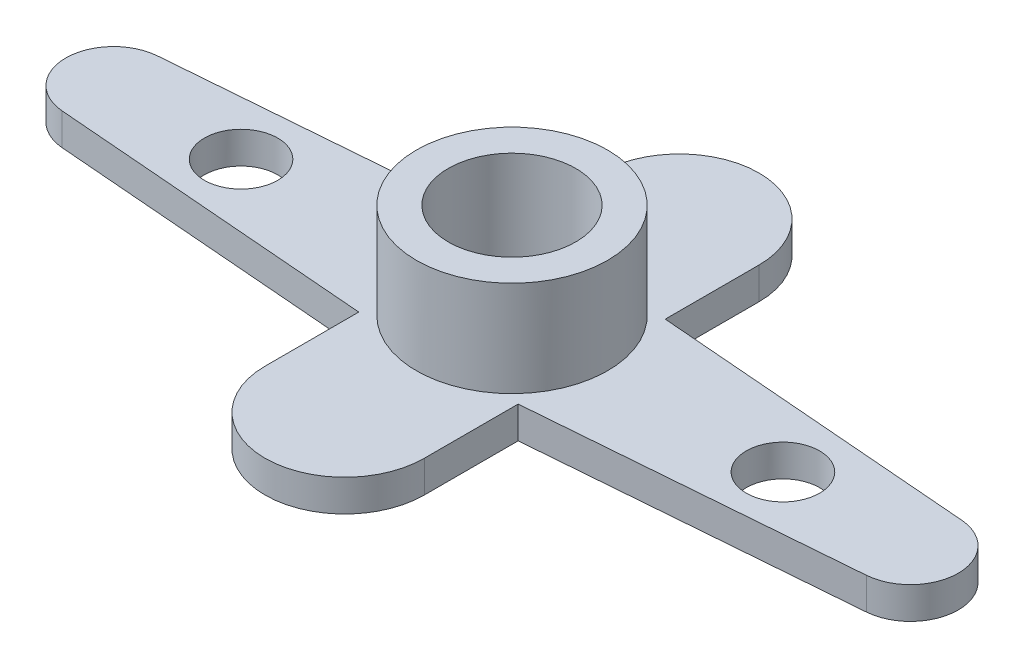
ISO-10303-21;
HEADER;
FILE_DESCRIPTION(('STEP AP214'),'2;1');
FILE_NAME('part.step','',(''),(''),'','','');
FILE_SCHEMA(('AUTOMOTIVE_DESIGN { 1 0 10303 214 1 1 1 1 }'));
ENDSEC;
DATA;
#1=APPLICATION_CONTEXT('core data for automotive mechanical design processes');
#2=APPLICATION_PROTOCOL_DEFINITION('international standard','automotive_design',2000,#1);
#3=PRODUCT_CONTEXT('',#1,'mechanical');
#4=PRODUCT('Part','Part','',(#3));
#5=PRODUCT_RELATED_PRODUCT_CATEGORY('part','',(#4));
#6=PRODUCT_DEFINITION_FORMATION('','',#4);
#7=PRODUCT_DEFINITION_CONTEXT('part definition',#1,'design');
#8=PRODUCT_DEFINITION('design','',#6,#7);
#9=PRODUCT_DEFINITION_SHAPE('','',#8);
#10=(LENGTH_UNIT() NAMED_UNIT(*) SI_UNIT(.MILLI.,.METRE.));
#11=(NAMED_UNIT(*) PLANE_ANGLE_UNIT() SI_UNIT($,.RADIAN.));
#12=(NAMED_UNIT(*) SI_UNIT($,.STERADIAN.) SOLID_ANGLE_UNIT());
#13=UNCERTAINTY_MEASURE_WITH_UNIT(LENGTH_MEASURE(1.E-05),#10,'distance_accuracy_value','');
#14=(GEOMETRIC_REPRESENTATION_CONTEXT(3) GLOBAL_UNCERTAINTY_ASSIGNED_CONTEXT((#13)) GLOBAL_UNIT_ASSIGNED_CONTEXT((#10,
#11,#12)) REPRESENTATION_CONTEXT('',''));
#15=CARTESIAN_POINT('',(0.,0.,0.));
#16=DIRECTION('',(0.,0.,1.));
#17=DIRECTION('',(1.,0.,0.));
#18=AXIS2_PLACEMENT_3D('',#15,#16,#17);
#19=CARTESIAN_POINT('',(12.5,1.,0.));
#20=DIRECTION('',(0.,-1.,0.));
#21=DIRECTION('',(0.,0.,-1.));
#22=AXIS2_PLACEMENT_3D('',#19,#20,#21);
#23=PLANE('',#22);
#24=CARTESIAN_POINT('',(12.5,1.,0.));
#25=DIRECTION('',(0.,1.,0.));
#26=DIRECTION('',(0.,0.,-1.));
#27=AXIS2_PLACEMENT_3D('',#24,#25,#26);
#28=CIRCLE('',#27,1.5);
#29=CARTESIAN_POINT('',(12.62,1.,1.49519229532525));
#30=VERTEX_POINT('',#29);
#31=CARTESIAN_POINT('',(12.62,1.,-1.49519229532525));
#32=VERTEX_POINT('',#31);
#33=EDGE_CURVE('E182',#30,#32,#28,.T.);
#34=ORIENTED_EDGE('',*,*,#33,.T.);
#35=DIRECTION('',(-0.996794863550169,0.,-0.08));
#36=VECTOR('',#35,1.);
#37=CARTESIAN_POINT('',(12.62,1.,-1.49519229532525));
#38=LINE('',#37,#36);
#39=CARTESIAN_POINT('',(2.5,1.,-2.30739551747724));
#40=VERTEX_POINT('',#39);
#41=EDGE_CURVE('E110',#32,#40,#38,.T.);
#42=ORIENTED_EDGE('',*,*,#41,.T.);
#43=DIRECTION('',(0.,0.,-1.));
#44=VECTOR('',#43,1.);
#45=CARTESIAN_POINT('',(2.5,1.,-2.30739551747724));
#46=LINE('',#45,#44);
#47=CARTESIAN_POINT('',(2.5,1.,-5.25));
#48=VERTEX_POINT('',#47);
#49=EDGE_CURVE('E232',#40,#48,#46,.T.);
#50=ORIENTED_EDGE('',*,*,#49,.T.);
#51=CARTESIAN_POINT('',(0.,1.,-5.25));
#52=DIRECTION('',(0.,1.,0.));
#53=DIRECTION('',(0.,0.,1.));
#54=AXIS2_PLACEMENT_3D('',#51,#52,#53);
#55=CIRCLE('',#54,2.5);
#56=CARTESIAN_POINT('',(-2.5,1.,-5.25));
#57=VERTEX_POINT('',#56);
#58=EDGE_CURVE('E234',#48,#57,#55,.T.);
#59=ORIENTED_EDGE('',*,*,#58,.T.);
#60=DIRECTION('',(0.,0.,1.));
#61=VECTOR('',#60,1.);
#62=CARTESIAN_POINT('',(-2.5,1.,-2.30739551747724));
#63=LINE('',#62,#61);
#64=CARTESIAN_POINT('',(-2.5,1.,-2.30739551747724));
#65=VERTEX_POINT('',#64);
#66=EDGE_CURVE('E236',#57,#65,#63,.T.);
#67=ORIENTED_EDGE('',*,*,#66,.T.);
#68=DIRECTION('',(-0.996794863550169,0.,0.08));
#69=VECTOR('',#68,1.);
#70=CARTESIAN_POINT('',(-12.62,1.,-1.49519229532525));
#71=LINE('',#70,#69);
#72=CARTESIAN_POINT('',(-12.62,1.,-1.49519229532525));
#73=VERTEX_POINT('',#72);
#74=EDGE_CURVE('E238',#65,#73,#71,.T.);
#75=ORIENTED_EDGE('',*,*,#74,.T.);
#76=CARTESIAN_POINT('',(-12.5,1.,0.));
#77=DIRECTION('',(0.,1.,0.));
#78=DIRECTION('',(0.,0.,1.));
#79=AXIS2_PLACEMENT_3D('',#76,#77,#78);
#80=CIRCLE('',#79,1.5);
#81=CARTESIAN_POINT('',(-12.62,1.,1.49519229532525));
#82=VERTEX_POINT('',#81);
#83=EDGE_CURVE('E240',#73,#82,#80,.T.);
#84=ORIENTED_EDGE('',*,*,#83,.T.);
#85=DIRECTION('',(0.996794863550169,0.,0.08));
#86=VECTOR('',#85,1.);
#87=CARTESIAN_POINT('',(-12.62,1.,1.49519229532525));
#88=LINE('',#87,#86);
#89=CARTESIAN_POINT('',(-2.5,1.,2.30739551747724));
#90=VERTEX_POINT('',#89);
#91=EDGE_CURVE('E242',#82,#90,#88,.T.);
#92=ORIENTED_EDGE('',*,*,#91,.T.);
#93=DIRECTION('',(0.,0.,1.));
#94=VECTOR('',#93,1.);
#95=CARTESIAN_POINT('',(-2.5,1.,2.30739551747724));
#96=LINE('',#95,#94);
#97=CARTESIAN_POINT('',(-2.5,1.,5.25));
#98=VERTEX_POINT('',#97);
#99=EDGE_CURVE('E141',#90,#98,#96,.T.);
#100=ORIENTED_EDGE('',*,*,#99,.T.);
#101=CARTESIAN_POINT('',(0.,1.,5.25));
#102=DIRECTION('',(0.,1.,0.));
#103=DIRECTION('',(0.,0.,-1.));
#104=AXIS2_PLACEMENT_3D('',#101,#102,#103);
#105=CIRCLE('',#104,2.5);
#106=CARTESIAN_POINT('',(2.5,1.,5.25));
#107=VERTEX_POINT('',#106);
#108=EDGE_CURVE('E135',#98,#107,#105,.T.);
#109=ORIENTED_EDGE('',*,*,#108,.T.);
#110=DIRECTION('',(0.,0.,-1.));
#111=VECTOR('',#110,1.);
#112=CARTESIAN_POINT('',(2.5,1.,2.30739551747724));
#113=LINE('',#112,#111);
#114=CARTESIAN_POINT('',(2.5,1.,2.30739551747724));
#115=VERTEX_POINT('',#114);
#116=EDGE_CURVE('E139',#107,#115,#113,.T.);
#117=ORIENTED_EDGE('',*,*,#116,.T.);
#118=DIRECTION('',(0.996794863550169,0.,-0.08));
#119=VECTOR('',#118,1.);
#120=CARTESIAN_POINT('',(12.62,1.,1.49519229532525));
#121=LINE('',#120,#119);
#122=EDGE_CURVE('E54',#115,#30,#121,.T.);
#123=ORIENTED_EDGE('',*,*,#122,.T.);
#124=EDGE_LOOP('',(#34,#42,#50,#59,#67,#75,#84,#92,#100,#109,#117,#123));
#125=FACE_BOUND('',#124,.T.);
#126=CARTESIAN_POINT('',(-8.5,1.,0.));
#127=DIRECTION('',(0.,1.,0.));
#128=DIRECTION('',(0.,0.,1.));
#129=AXIS2_PLACEMENT_3D('',#126,#127,#128);
#130=CIRCLE('',#129,1.15);
#131=CARTESIAN_POINT('',(-8.5,1.,1.15));
#132=VERTEX_POINT('',#131);
#133=EDGE_CURVE('E210',#132,#132,#130,.T.);
#134=ORIENTED_EDGE('',*,*,#133,.F.);
#135=EDGE_LOOP('',(#134));
#136=FACE_BOUND('',#135,.T.);
#137=CARTESIAN_POINT('',(8.5,1.,0.));
#138=DIRECTION('',(0.,1.,0.));
#139=DIRECTION('',(0.,0.,1.));
#140=AXIS2_PLACEMENT_3D('',#137,#138,#139);
#141=CIRCLE('',#140,1.15);
#142=CARTESIAN_POINT('',(8.5,1.,1.15));
#143=VERTEX_POINT('',#142);
#144=EDGE_CURVE('E213',#143,#143,#141,.T.);
#145=ORIENTED_EDGE('',*,*,#144,.F.);
#146=EDGE_LOOP('',(#145));
#147=FACE_BOUND('',#146,.T.);
#148=CARTESIAN_POINT('',(0.,1.,0.));
#149=DIRECTION('',(0.,-1.,0.));
#150=DIRECTION('',(0.,0.,-1.));
#151=AXIS2_PLACEMENT_3D('',#148,#149,#150);
#152=CIRCLE('',#151,3.);
#153=CARTESIAN_POINT('',(0.,1.,-3.));
#154=VERTEX_POINT('',#153);
#155=EDGE_CURVE('E11',#154,#154,#152,.F.);
#156=ORIENTED_EDGE('',*,*,#155,.F.);
#157=EDGE_LOOP('',(#156));
#158=FACE_BOUND('',#157,.T.);
#159=ADVANCED_FACE('F37',(#125,#136,#147,#158),#23,.F.);
#160=CARTESIAN_POINT('',(12.5,0.,0.));
#161=DIRECTION('',(0.,-1.,0.));
#162=DIRECTION('',(0.,0.,-1.));
#163=AXIS2_PLACEMENT_3D('',#160,#161,#162);
#164=PLANE('',#163);
#165=CARTESIAN_POINT('',(8.5,0.,0.));
#166=DIRECTION('',(0.,-1.,0.));
#167=DIRECTION('',(0.,0.,-1.));
#168=AXIS2_PLACEMENT_3D('',#165,#166,#167);
#169=CIRCLE('',#168,1.15);
#170=CARTESIAN_POINT('',(8.5,0.,-1.15));
#171=VERTEX_POINT('',#170);
#172=EDGE_CURVE('E211',#171,#171,#169,.T.);
#173=ORIENTED_EDGE('',*,*,#172,.F.);
#174=EDGE_LOOP('',(#173));
#175=FACE_BOUND('',#174,.T.);
#176=CARTESIAN_POINT('',(-8.5,0.,0.));
#177=DIRECTION('',(0.,-1.,0.));
#178=DIRECTION('',(0.,0.,-1.));
#179=AXIS2_PLACEMENT_3D('',#176,#177,#178);
#180=CIRCLE('',#179,1.15);
#181=CARTESIAN_POINT('',(-8.5,0.,-1.15));
#182=VERTEX_POINT('',#181);
#183=EDGE_CURVE('E208',#182,#182,#180,.T.);
#184=ORIENTED_EDGE('',*,*,#183,.F.);
#185=EDGE_LOOP('',(#184));
#186=FACE_BOUND('',#185,.T.);
#187=CARTESIAN_POINT('',(12.5,0.,0.));
#188=DIRECTION('',(0.,1.,0.));
#189=DIRECTION('',(0.,0.,-1.));
#190=AXIS2_PLACEMENT_3D('',#187,#188,#189);
#191=CIRCLE('',#190,1.5);
#192=CARTESIAN_POINT('',(12.62,0.,1.49519229532525));
#193=VERTEX_POINT('',#192);
#194=CARTESIAN_POINT('',(12.62,0.,-1.49519229532525));
#195=VERTEX_POINT('',#194);
#196=EDGE_CURVE('E159',#193,#195,#191,.T.);
#197=ORIENTED_EDGE('',*,*,#196,.F.);
#198=DIRECTION('',(0.996794863550169,0.,-0.08));
#199=VECTOR('',#198,1.);
#200=CARTESIAN_POINT('',(12.62,0.,1.49519229532525));
#201=LINE('',#200,#199);
#202=CARTESIAN_POINT('',(2.5,0.,2.30739551747724));
#203=VERTEX_POINT('',#202);
#204=EDGE_CURVE('E101',#203,#193,#201,.T.);
#205=ORIENTED_EDGE('',*,*,#204,.F.);
#206=DIRECTION('',(0.,0.,-1.));
#207=VECTOR('',#206,1.);
#208=CARTESIAN_POINT('',(2.5,0.,2.30739551747724));
#209=LINE('',#208,#207);
#210=CARTESIAN_POINT('',(2.5,0.,5.25));
#211=VERTEX_POINT('',#210);
#212=EDGE_CURVE('E95',#211,#203,#209,.T.);
#213=ORIENTED_EDGE('',*,*,#212,.F.);
#214=CARTESIAN_POINT('',(0.,0.,5.25));
#215=DIRECTION('',(0.,1.,0.));
#216=DIRECTION('',(0.,0.,-1.));
#217=AXIS2_PLACEMENT_3D('',#214,#215,#216);
#218=CIRCLE('',#217,2.5);
#219=CARTESIAN_POINT('',(-2.5,0.,5.25));
#220=VERTEX_POINT('',#219);
#221=EDGE_CURVE('E149',#220,#211,#218,.T.);
#222=ORIENTED_EDGE('',*,*,#221,.F.);
#223=DIRECTION('',(0.,0.,1.));
#224=VECTOR('',#223,1.);
#225=CARTESIAN_POINT('',(-2.5,0.,2.30739551747724));
#226=LINE('',#225,#224);
#227=CARTESIAN_POINT('',(-2.5,0.,2.30739551747724));
#228=VERTEX_POINT('',#227);
#229=EDGE_CURVE('E177',#228,#220,#226,.T.);
#230=ORIENTED_EDGE('',*,*,#229,.F.);
#231=DIRECTION('',(0.996794863550169,0.,0.08));
#232=VECTOR('',#231,1.);
#233=CARTESIAN_POINT('',(-12.62,0.,1.49519229532525));
#234=LINE('',#233,#232);
#235=CARTESIAN_POINT('',(-12.62,0.,1.49519229532525));
#236=VERTEX_POINT('',#235);
#237=EDGE_CURVE('E175',#236,#228,#234,.T.);
#238=ORIENTED_EDGE('',*,*,#237,.F.);
#239=CARTESIAN_POINT('',(-12.5,0.,0.));
#240=DIRECTION('',(0.,1.,0.));
#241=DIRECTION('',(0.,0.,1.));
#242=AXIS2_PLACEMENT_3D('',#239,#240,#241);
#243=CIRCLE('',#242,1.5);
#244=CARTESIAN_POINT('',(-12.62,0.,-1.49519229532525));
#245=VERTEX_POINT('',#244);
#246=EDGE_CURVE('E173',#245,#236,#243,.T.);
#247=ORIENTED_EDGE('',*,*,#246,.F.);
#248=DIRECTION('',(-0.996794863550169,0.,0.08));
#249=VECTOR('',#248,1.);
#250=CARTESIAN_POINT('',(-12.62,0.,-1.49519229532525));
#251=LINE('',#250,#249);
#252=CARTESIAN_POINT('',(-2.5,0.,-2.30739551747724));
#253=VERTEX_POINT('',#252);
#254=EDGE_CURVE('E171',#253,#245,#251,.T.);
#255=ORIENTED_EDGE('',*,*,#254,.F.);
#256=DIRECTION('',(0.,0.,1.));
#257=VECTOR('',#256,1.);
#258=CARTESIAN_POINT('',(-2.5,0.,-2.30739551747724));
#259=LINE('',#258,#257);
#260=CARTESIAN_POINT('',(-2.5,0.,-5.25));
#261=VERTEX_POINT('',#260);
#262=EDGE_CURVE('E169',#261,#253,#259,.T.);
#263=ORIENTED_EDGE('',*,*,#262,.F.);
#264=CARTESIAN_POINT('',(0.,0.,-5.25));
#265=DIRECTION('',(0.,1.,0.));
#266=DIRECTION('',(0.,0.,1.));
#267=AXIS2_PLACEMENT_3D('',#264,#265,#266);
#268=CIRCLE('',#267,2.5);
#269=CARTESIAN_POINT('',(2.5,0.,-5.25));
#270=VERTEX_POINT('',#269);
#271=EDGE_CURVE('E167',#270,#261,#268,.T.);
#272=ORIENTED_EDGE('',*,*,#271,.F.);
#273=DIRECTION('',(0.,0.,-1.));
#274=VECTOR('',#273,1.);
#275=CARTESIAN_POINT('',(2.5,0.,-2.30739551747724));
#276=LINE('',#275,#274);
#277=CARTESIAN_POINT('',(2.5,0.,-2.30739551747724));
#278=VERTEX_POINT('',#277);
#279=EDGE_CURVE('E165',#278,#270,#276,.T.);
#280=ORIENTED_EDGE('',*,*,#279,.F.);
#281=DIRECTION('',(-0.996794863550169,0.,-0.08));
#282=VECTOR('',#281,1.);
#283=CARTESIAN_POINT('',(12.62,0.,-1.49519229532525));
#284=LINE('',#283,#282);
#285=EDGE_CURVE('E162',#195,#278,#284,.T.);
#286=ORIENTED_EDGE('',*,*,#285,.F.);
#287=EDGE_LOOP('',(#197,#205,#213,#222,#230,#238,#247,#255,#263,#272,#280,#286));
#288=FACE_BOUND('',#287,.T.);
#289=CARTESIAN_POINT('',(0.,0.,0.));
#290=DIRECTION('',(0.,1.,0.));
#291=DIRECTION('',(0.,0.,1.));
#292=AXIS2_PLACEMENT_3D('',#289,#290,#291);
#293=CIRCLE('',#292,2.);
#294=CARTESIAN_POINT('',(0.,0.,2.));
#295=VERTEX_POINT('',#294);
#296=EDGE_CURVE('E163',#295,#295,#293,.T.);
#297=ORIENTED_EDGE('',*,*,#296,.T.);
#298=EDGE_LOOP('',(#297));
#299=FACE_BOUND('',#298,.T.);
#300=ADVANCED_FACE('F255',(#175,#186,#288,#299),#164,.T.);
#301=CARTESIAN_POINT('',(12.5,1.,0.));
#302=DIRECTION('',(0.,-1.,0.));
#303=DIRECTION('',(0.,0.,-1.));
#304=AXIS2_PLACEMENT_3D('',#301,#302,#303);
#305=CYLINDRICAL_SURFACE('',#304,1.5);
#306=ORIENTED_EDGE('',*,*,#196,.T.);
#307=DIRECTION('',(0.,-1.,0.));
#308=VECTOR('',#307,1.);
#309=CARTESIAN_POINT('',(12.62,1.,-1.49519229532525));
#310=LINE('',#309,#308);
#311=EDGE_CURVE('E46',#32,#195,#310,.T.);
#312=ORIENTED_EDGE('',*,*,#311,.F.);
#313=ORIENTED_EDGE('',*,*,#33,.F.);
#314=DIRECTION('',(0.,-1.,0.));
#315=VECTOR('',#314,1.);
#316=CARTESIAN_POINT('',(12.62,1.,1.49519229532525));
#317=LINE('',#316,#315);
#318=EDGE_CURVE('E155',#30,#193,#317,.T.);
#319=ORIENTED_EDGE('',*,*,#318,.T.);
#320=EDGE_LOOP('',(#306,#312,#313,#319));
#321=FACE_BOUND('',#320,.T.);
#322=ADVANCED_FACE('F39',(#321),#305,.T.);
#323=CARTESIAN_POINT('',(12.62,1.,-1.49519229532525));
#324=DIRECTION('',(-0.08,0.,0.996794863550169));
#325=DIRECTION('',(0.996794863550169,0.,0.08));
#326=AXIS2_PLACEMENT_3D('',#323,#324,#325);
#327=PLANE('',#326);
#328=ORIENTED_EDGE('',*,*,#285,.T.);
#329=DIRECTION('',(0.,-1.,0.));
#330=VECTOR('',#329,1.);
#331=CARTESIAN_POINT('',(2.5,1.,-2.30739551747724));
#332=LINE('',#331,#330);
#333=EDGE_CURVE('E204',#40,#278,#332,.T.);
#334=ORIENTED_EDGE('',*,*,#333,.F.);
#335=ORIENTED_EDGE('',*,*,#41,.F.);
#336=ORIENTED_EDGE('',*,*,#311,.T.);
#337=EDGE_LOOP('',(#328,#334,#335,#336));
#338=FACE_BOUND('',#337,.T.);
#339=ADVANCED_FACE('F426',(#338),#327,.F.);
#340=CARTESIAN_POINT('',(2.5,1.,-2.30739551747724));
#341=DIRECTION('',(-1.,0.,0.));
#342=DIRECTION('',(0.,0.,1.));
#343=AXIS2_PLACEMENT_3D('',#340,#341,#342);
#344=PLANE('',#343);
#345=ORIENTED_EDGE('',*,*,#279,.T.);
#346=DIRECTION('',(0.,-1.,0.));
#347=VECTOR('',#346,1.);
#348=CARTESIAN_POINT('',(2.5,1.,-5.25));
#349=LINE('',#348,#347);
#350=EDGE_CURVE('E201',#48,#270,#349,.T.);
#351=ORIENTED_EDGE('',*,*,#350,.F.);
#352=ORIENTED_EDGE('',*,*,#49,.F.);
#353=ORIENTED_EDGE('',*,*,#333,.T.);
#354=EDGE_LOOP('',(#345,#351,#352,#353));
#355=FACE_BOUND('',#354,.T.);
#356=ADVANCED_FACE('F416',(#355),#344,.F.);
#357=CARTESIAN_POINT('',(0.,1.,-5.25));
#358=DIRECTION('',(0.,-1.,0.));
#359=DIRECTION('',(0.,0.,-1.));
#360=AXIS2_PLACEMENT_3D('',#357,#358,#359);
#361=CYLINDRICAL_SURFACE('',#360,2.5);
#362=ORIENTED_EDGE('',*,*,#271,.T.);
#363=DIRECTION('',(0.,-1.,0.));
#364=VECTOR('',#363,1.);
#365=CARTESIAN_POINT('',(-2.5,1.,-5.25));
#366=LINE('',#365,#364);
#367=EDGE_CURVE('E198',#57,#261,#366,.T.);
#368=ORIENTED_EDGE('',*,*,#367,.F.);
#369=ORIENTED_EDGE('',*,*,#58,.F.);
#370=ORIENTED_EDGE('',*,*,#350,.T.);
#371=EDGE_LOOP('',(#362,#368,#369,#370));
#372=FACE_BOUND('',#371,.T.);
#373=ADVANCED_FACE('F406',(#372),#361,.T.);
#374=CARTESIAN_POINT('',(-2.5,1.,-2.30739551747724));
#375=DIRECTION('',(1.,0.,0.));
#376=DIRECTION('',(0.,0.,-1.));
#377=AXIS2_PLACEMENT_3D('',#374,#375,#376);
#378=PLANE('',#377);
#379=ORIENTED_EDGE('',*,*,#262,.T.);
#380=DIRECTION('',(0.,-1.,0.));
#381=VECTOR('',#380,1.);
#382=CARTESIAN_POINT('',(-2.5,1.,-2.30739551747724));
#383=LINE('',#382,#381);
#384=EDGE_CURVE('E195',#65,#253,#383,.T.);
#385=ORIENTED_EDGE('',*,*,#384,.F.);
#386=ORIENTED_EDGE('',*,*,#66,.F.);
#387=ORIENTED_EDGE('',*,*,#367,.T.);
#388=EDGE_LOOP('',(#379,#385,#386,#387));
#389=FACE_BOUND('',#388,.T.);
#390=ADVANCED_FACE('F396',(#389),#378,.F.);
#391=CARTESIAN_POINT('',(-12.62,1.,-1.49519229532525));
#392=DIRECTION('',(0.08,0.,0.996794863550169));
#393=DIRECTION('',(0.996794863550169,0.,-0.08));
#394=AXIS2_PLACEMENT_3D('',#391,#392,#393);
#395=PLANE('',#394);
#396=ORIENTED_EDGE('',*,*,#254,.T.);
#397=DIRECTION('',(0.,-1.,0.));
#398=VECTOR('',#397,1.);
#399=CARTESIAN_POINT('',(-12.62,1.,-1.49519229532525));
#400=LINE('',#399,#398);
#401=EDGE_CURVE('E192',#73,#245,#400,.T.);
#402=ORIENTED_EDGE('',*,*,#401,.F.);
#403=ORIENTED_EDGE('',*,*,#74,.F.);
#404=ORIENTED_EDGE('',*,*,#384,.T.);
#405=EDGE_LOOP('',(#396,#402,#403,#404));
#406=FACE_BOUND('',#405,.T.);
#407=ADVANCED_FACE('F386',(#406),#395,.F.);
#408=CARTESIAN_POINT('',(-12.5,1.,0.));
#409=DIRECTION('',(0.,-1.,0.));
#410=DIRECTION('',(0.,0.,-1.));
#411=AXIS2_PLACEMENT_3D('',#408,#409,#410);
#412=CYLINDRICAL_SURFACE('',#411,1.5);
#413=ORIENTED_EDGE('',*,*,#246,.T.);
#414=DIRECTION('',(0.,-1.,0.));
#415=VECTOR('',#414,1.);
#416=CARTESIAN_POINT('',(-12.62,1.,1.49519229532525));
#417=LINE('',#416,#415);
#418=EDGE_CURVE('E189',#82,#236,#417,.T.);
#419=ORIENTED_EDGE('',*,*,#418,.F.);
#420=ORIENTED_EDGE('',*,*,#83,.F.);
#421=ORIENTED_EDGE('',*,*,#401,.T.);
#422=EDGE_LOOP('',(#413,#419,#420,#421));
#423=FACE_BOUND('',#422,.T.);
#424=ADVANCED_FACE('F377',(#423),#412,.T.);
#425=CARTESIAN_POINT('',(-12.62,1.,1.49519229532525));
#426=DIRECTION('',(0.08,0.,-0.996794863550169));
#427=DIRECTION('',(-0.996794863550169,0.,-0.08));
#428=AXIS2_PLACEMENT_3D('',#425,#426,#427);
#429=PLANE('',#428);
#430=ORIENTED_EDGE('',*,*,#237,.T.);
#431=DIRECTION('',(0.,-1.,0.));
#432=VECTOR('',#431,1.);
#433=CARTESIAN_POINT('',(-2.5,1.,2.30739551747724));
#434=LINE('',#433,#432);
#435=EDGE_CURVE('E186',#90,#228,#434,.T.);
#436=ORIENTED_EDGE('',*,*,#435,.F.);
#437=ORIENTED_EDGE('',*,*,#91,.F.);
#438=ORIENTED_EDGE('',*,*,#418,.T.);
#439=EDGE_LOOP('',(#430,#436,#437,#438));
#440=FACE_BOUND('',#439,.T.);
#441=ADVANCED_FACE('F248',(#440),#429,.F.);
#442=CARTESIAN_POINT('',(-2.5,1.,2.30739551747724));
#443=DIRECTION('',(1.,0.,0.));
#444=DIRECTION('',(0.,0.,-1.));
#445=AXIS2_PLACEMENT_3D('',#442,#443,#444);
#446=PLANE('',#445);
#447=ORIENTED_EDGE('',*,*,#229,.T.);
#448=DIRECTION('',(0.,-1.,0.));
#449=VECTOR('',#448,1.);
#450=CARTESIAN_POINT('',(-2.5,1.,5.25));
#451=LINE('',#450,#449);
#452=EDGE_CURVE('E150',#98,#220,#451,.T.);
#453=ORIENTED_EDGE('',*,*,#452,.F.);
#454=ORIENTED_EDGE('',*,*,#99,.F.);
#455=ORIENTED_EDGE('',*,*,#435,.T.);
#456=EDGE_LOOP('',(#447,#453,#454,#455));
#457=FACE_BOUND('',#456,.T.);
#458=ADVANCED_FACE('F252',(#457),#446,.F.);
#459=CARTESIAN_POINT('',(0.,1.,5.25));
#460=DIRECTION('',(0.,-1.,0.));
#461=DIRECTION('',(0.,0.,-1.));
#462=AXIS2_PLACEMENT_3D('',#459,#460,#461);
#463=CYLINDRICAL_SURFACE('',#462,2.5);
#464=ORIENTED_EDGE('',*,*,#221,.T.);
#465=DIRECTION('',(0.,-1.,0.));
#466=VECTOR('',#465,1.);
#467=CARTESIAN_POINT('',(2.5,1.,5.25));
#468=LINE('',#467,#466);
#469=EDGE_CURVE('E146',#107,#211,#468,.T.);
#470=ORIENTED_EDGE('',*,*,#469,.F.);
#471=ORIENTED_EDGE('',*,*,#108,.F.);
#472=ORIENTED_EDGE('',*,*,#452,.T.);
#473=EDGE_LOOP('',(#464,#470,#471,#472));
#474=FACE_BOUND('',#473,.T.);
#475=ADVANCED_FACE('F147',(#474),#463,.T.);
#476=CARTESIAN_POINT('',(2.5,1.,2.30739551747724));
#477=DIRECTION('',(-1.,0.,0.));
#478=DIRECTION('',(0.,0.,1.));
#479=AXIS2_PLACEMENT_3D('',#476,#477,#478);
#480=PLANE('',#479);
#481=ORIENTED_EDGE('',*,*,#212,.T.);
#482=DIRECTION('',(0.,-1.,0.));
#483=VECTOR('',#482,1.);
#484=CARTESIAN_POINT('',(2.5,1.,2.30739551747724));
#485=LINE('',#484,#483);
#486=EDGE_CURVE('E151',#115,#203,#485,.T.);
#487=ORIENTED_EDGE('',*,*,#486,.F.);
#488=ORIENTED_EDGE('',*,*,#116,.F.);
#489=ORIENTED_EDGE('',*,*,#469,.T.);
#490=EDGE_LOOP('',(#481,#487,#488,#489));
#491=FACE_BOUND('',#490,.T.);
#492=ADVANCED_FACE('F153',(#491),#480,.F.);
#493=CARTESIAN_POINT('',(12.62,1.,1.49519229532525));
#494=DIRECTION('',(-0.08,0.,-0.996794863550169));
#495=DIRECTION('',(-0.996794863550169,0.,0.08));
#496=AXIS2_PLACEMENT_3D('',#493,#494,#495);
#497=PLANE('',#496);
#498=ORIENTED_EDGE('',*,*,#204,.T.);
#499=ORIENTED_EDGE('',*,*,#318,.F.);
#500=ORIENTED_EDGE('',*,*,#122,.F.);
#501=ORIENTED_EDGE('',*,*,#486,.T.);
#502=EDGE_LOOP('',(#498,#499,#500,#501));
#503=FACE_BOUND('',#502,.T.);
#504=ADVANCED_FACE('F261',(#503),#497,.F.);
#505=CARTESIAN_POINT('',(0.,1.,0.));
#506=DIRECTION('',(0.,-1.,0.));
#507=DIRECTION('',(0.,0.,-1.));
#508=AXIS2_PLACEMENT_3D('',#505,#506,#507);
#509=CYLINDRICAL_SURFACE('',#508,2.);
#510=ORIENTED_EDGE('',*,*,#296,.F.);
#511=EDGE_LOOP('',(#510));
#512=FACE_BOUND('',#511,.T.);
#513=CARTESIAN_POINT('',(0.,4.,0.));
#514=DIRECTION('',(0.,1.,0.));
#515=DIRECTION('',(0.,0.,1.));
#516=AXIS2_PLACEMENT_3D('',#513,#514,#515);
#517=CIRCLE('',#516,2.);
#518=CARTESIAN_POINT('',(0.,4.,2.));
#519=VERTEX_POINT('',#518);
#520=EDGE_CURVE('E224',#519,#519,#517,.T.);
#521=ORIENTED_EDGE('',*,*,#520,.T.);
#522=EDGE_LOOP('',(#521));
#523=FACE_BOUND('',#522,.T.);
#524=ADVANCED_FACE('F263',(#512,#523),#509,.F.);
#525=CARTESIAN_POINT('',(-8.5,-1.,0.));
#526=DIRECTION('',(0.,1.,0.));
#527=DIRECTION('',(0.,0.,1.));
#528=AXIS2_PLACEMENT_3D('',#525,#526,#527);
#529=CYLINDRICAL_SURFACE('',#528,1.15);
#530=ORIENTED_EDGE('',*,*,#183,.T.);
#531=EDGE_LOOP('',(#530));
#532=FACE_BOUND('',#531,.T.);
#533=ORIENTED_EDGE('',*,*,#133,.T.);
#534=EDGE_LOOP('',(#533));
#535=FACE_BOUND('',#534,.T.);
#536=ADVANCED_FACE('F269',(#532,#535),#529,.F.);
#537=CARTESIAN_POINT('',(8.5,-1.,0.));
#538=DIRECTION('',(0.,1.,0.));
#539=DIRECTION('',(0.,0.,1.));
#540=AXIS2_PLACEMENT_3D('',#537,#538,#539);
#541=CYLINDRICAL_SURFACE('',#540,1.15);
#542=ORIENTED_EDGE('',*,*,#172,.T.);
#543=EDGE_LOOP('',(#542));
#544=FACE_BOUND('',#543,.T.);
#545=ORIENTED_EDGE('',*,*,#144,.T.);
#546=EDGE_LOOP('',(#545));
#547=FACE_BOUND('',#546,.T.);
#548=ADVANCED_FACE('F283',(#544,#547),#541,.F.);
#549=CARTESIAN_POINT('',(0.,4.,0.));
#550=DIRECTION('',(0.,1.,0.));
#551=DIRECTION('',(0.,0.,1.));
#552=AXIS2_PLACEMENT_3D('',#549,#550,#551);
#553=PLANE('',#552);
#554=CARTESIAN_POINT('',(0.,4.,0.));
#555=DIRECTION('',(0.,1.,0.));
#556=DIRECTION('',(0.,0.,1.));
#557=AXIS2_PLACEMENT_3D('',#554,#555,#556);
#558=CIRCLE('',#557,3.);
#559=CARTESIAN_POINT('',(0.,4.,3.));
#560=VERTEX_POINT('',#559);
#561=EDGE_CURVE('E219',#560,#560,#558,.T.);
#562=ORIENTED_EDGE('',*,*,#561,.T.);
#563=EDGE_LOOP('',(#562));
#564=FACE_BOUND('',#563,.T.);
#565=ORIENTED_EDGE('',*,*,#520,.F.);
#566=EDGE_LOOP('',(#565));
#567=FACE_BOUND('',#566,.T.);
#568=ADVANCED_FACE('F287',(#564,#567),#553,.T.);
#569=CARTESIAN_POINT('',(0.,4.,0.));
#570=DIRECTION('',(0.,-1.,0.));
#571=DIRECTION('',(0.,0.,-1.));
#572=AXIS2_PLACEMENT_3D('',#569,#570,#571);
#573=CYLINDRICAL_SURFACE('',#572,3.);
#574=ORIENTED_EDGE('',*,*,#561,.F.);
#575=EDGE_LOOP('',(#574));
#576=FACE_BOUND('',#575,.T.);
#577=ORIENTED_EDGE('',*,*,#155,.T.);
#578=EDGE_LOOP('',(#577));
#579=FACE_BOUND('',#578,.T.);
#580=ADVANCED_FACE('F288',(#576,#579),#573,.T.);
#581=CLOSED_SHELL('',(#159,#300,#322,#339,#356,#373,#390,#407,#424,#441,#458,#475,#492,#504,
#524,#536,#548,#568,#580));
#582=MANIFOLD_SOLID_BREP('B2',#581);
#583=ADVANCED_BREP_SHAPE_REPRESENTATION('',(#18,#582),#14);
#584=SHAPE_DEFINITION_REPRESENTATION(#9,#583);
ENDSEC;
END-ISO-10303-21;
